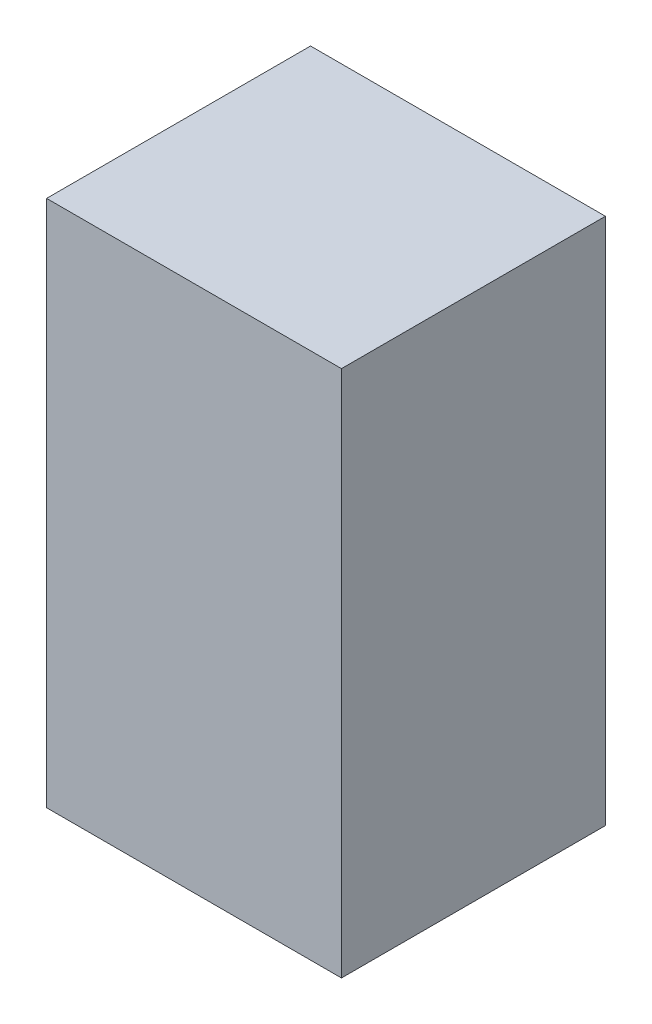
ISO-10303-21;
HEADER;
FILE_DESCRIPTION(('STEP AP214'),'2;1');
FILE_NAME('part.step','',(''),(''),'','','');
FILE_SCHEMA(('AUTOMOTIVE_DESIGN { 1 0 10303 214 1 1 1 1 }'));
ENDSEC;
DATA;
#1=APPLICATION_CONTEXT('core data for automotive mechanical design processes');
#2=APPLICATION_PROTOCOL_DEFINITION('international standard','automotive_design',2000,#1);
#3=PRODUCT_CONTEXT('',#1,'mechanical');
#4=PRODUCT('Part','Part','',(#3));
#5=PRODUCT_RELATED_PRODUCT_CATEGORY('part','',(#4));
#6=PRODUCT_DEFINITION_FORMATION('','',#4);
#7=PRODUCT_DEFINITION_CONTEXT('part definition',#1,'design');
#8=PRODUCT_DEFINITION('design','',#6,#7);
#9=PRODUCT_DEFINITION_SHAPE('','',#8);
#10=(LENGTH_UNIT() NAMED_UNIT(*) SI_UNIT(.MILLI.,.METRE.));
#11=(NAMED_UNIT(*) PLANE_ANGLE_UNIT() SI_UNIT($,.RADIAN.));
#12=(NAMED_UNIT(*) SI_UNIT($,.STERADIAN.) SOLID_ANGLE_UNIT());
#13=UNCERTAINTY_MEASURE_WITH_UNIT(LENGTH_MEASURE(1.E-05),#10,'distance_accuracy_value','');
#14=(GEOMETRIC_REPRESENTATION_CONTEXT(3) GLOBAL_UNCERTAINTY_ASSIGNED_CONTEXT((#13)) GLOBAL_UNIT_ASSIGNED_CONTEXT((#10,
#11,#12)) REPRESENTATION_CONTEXT('',''));
#15=CARTESIAN_POINT('',(0.,0.,0.));
#16=DIRECTION('',(0.,0.,1.));
#17=DIRECTION('',(1.,0.,0.));
#18=AXIS2_PLACEMENT_3D('',#15,#16,#17);
#19=CARTESIAN_POINT('',(10.5586046066208,7.55564646799176,2.));
#20=DIRECTION('',(0.,0.,1.));
#21=DIRECTION('',(1.,0.,0.));
#22=AXIS2_PLACEMENT_3D('',#19,#20,#21);
#23=PLANE('',#22);
#24=DIRECTION('',(-1.,0.,0.));
#25=VECTOR('',#24,1.);
#26=CARTESIAN_POINT('',(11.11720906423,6.55586150390983,2.));
#27=LINE('',#26,#25);
#28=CARTESIAN_POINT('',(11.11720906423,6.55586150390983,2.));
#29=VERTEX_POINT('',#28);
#30=CARTESIAN_POINT('',(10.0000001490116,6.55586150390983,2.));
#31=VERTEX_POINT('',#30);
#32=EDGE_CURVE('E27',#29,#31,#27,.T.);
#33=ORIENTED_EDGE('',*,*,#32,.T.);
#34=DIRECTION('',(0.,1.,0.));
#35=VECTOR('',#34,1.);
#36=CARTESIAN_POINT('',(10.0000001490116,6.55586150390983,2.));
#37=LINE('',#36,#35);
#38=CARTESIAN_POINT('',(10.0000001490116,8.55543143207368,2.));
#39=VERTEX_POINT('',#38);
#40=EDGE_CURVE('E90',#31,#39,#37,.T.);
#41=ORIENTED_EDGE('',*,*,#40,.T.);
#42=DIRECTION('',(1.,0.,0.));
#43=VECTOR('',#42,1.);
#44=CARTESIAN_POINT('',(10.0000001490116,8.55543143207368,2.));
#45=LINE('',#44,#43);
#46=CARTESIAN_POINT('',(11.11720906423,8.55543143207368,2.));
#47=VERTEX_POINT('',#46);
#48=EDGE_CURVE('E83',#39,#47,#45,.T.);
#49=ORIENTED_EDGE('',*,*,#48,.T.);
#50=DIRECTION('',(0.,-1.,0.));
#51=VECTOR('',#50,1.);
#52=CARTESIAN_POINT('',(11.11720906423,8.55543143207368,2.));
#53=LINE('',#52,#51);
#54=EDGE_CURVE('E71',#47,#29,#53,.T.);
#55=ORIENTED_EDGE('',*,*,#54,.T.);
#56=EDGE_LOOP('',(#33,#41,#49,#55));
#57=FACE_BOUND('',#56,.T.);
#58=ADVANCED_FACE('F17',(#57),#23,.F.);
#59=CARTESIAN_POINT('',(10.5586046066208,7.55564646799176,3.));
#60=DIRECTION('',(0.,0.,1.));
#61=DIRECTION('',(1.,0.,0.));
#62=AXIS2_PLACEMENT_3D('',#59,#60,#61);
#63=PLANE('',#62);
#64=DIRECTION('',(1.,0.,0.));
#65=VECTOR('',#64,1.);
#66=CARTESIAN_POINT('',(11.11720906423,6.55586150390983,3.));
#67=LINE('',#66,#65);
#68=CARTESIAN_POINT('',(10.0000001490116,6.55586150390983,3.));
#69=VERTEX_POINT('',#68);
#70=CARTESIAN_POINT('',(11.11720906423,6.55586150390983,3.));
#71=VERTEX_POINT('',#70);
#72=EDGE_CURVE('E11',#69,#71,#67,.T.);
#73=ORIENTED_EDGE('',*,*,#72,.T.);
#74=DIRECTION('',(0.,1.,0.));
#75=VECTOR('',#74,1.);
#76=CARTESIAN_POINT('',(11.11720906423,8.55543143207368,3.));
#77=LINE('',#76,#75);
#78=CARTESIAN_POINT('',(11.11720906423,8.55543143207368,3.));
#79=VERTEX_POINT('',#78);
#80=EDGE_CURVE('E63',#71,#79,#77,.T.);
#81=ORIENTED_EDGE('',*,*,#80,.T.);
#82=DIRECTION('',(-1.,0.,0.));
#83=VECTOR('',#82,1.);
#84=CARTESIAN_POINT('',(10.0000001490116,8.55543143207368,3.));
#85=LINE('',#84,#83);
#86=CARTESIAN_POINT('',(10.0000001490116,8.55543143207368,3.));
#87=VERTEX_POINT('',#86);
#88=EDGE_CURVE('E85',#79,#87,#85,.T.);
#89=ORIENTED_EDGE('',*,*,#88,.T.);
#90=DIRECTION('',(0.,-1.,0.));
#91=VECTOR('',#90,1.);
#92=CARTESIAN_POINT('',(10.0000001490116,6.55586150390983,3.));
#93=LINE('',#92,#91);
#94=EDGE_CURVE('E98',#87,#69,#93,.T.);
#95=ORIENTED_EDGE('',*,*,#94,.T.);
#96=EDGE_LOOP('',(#73,#81,#89,#95));
#97=FACE_BOUND('',#96,.T.);
#98=ADVANCED_FACE('F119',(#97),#63,.T.);
#99=CARTESIAN_POINT('',(10.0000001490116,6.55586150390983,2.));
#100=DIRECTION('',(0.,-1.,0.));
#101=DIRECTION('',(0.,0.,-1.));
#102=AXIS2_PLACEMENT_3D('',#99,#100,#101);
#103=PLANE('',#102);
#104=ORIENTED_EDGE('',*,*,#32,.F.);
#105=DIRECTION('',(0.,0.,1.));
#106=VECTOR('',#105,1.);
#107=CARTESIAN_POINT('',(11.11720906423,6.55586150390983,2.));
#108=LINE('',#107,#106);
#109=EDGE_CURVE('E20',#29,#71,#108,.T.);
#110=ORIENTED_EDGE('',*,*,#109,.T.);
#111=ORIENTED_EDGE('',*,*,#72,.F.);
#112=DIRECTION('',(0.,0.,1.));
#113=VECTOR('',#112,1.);
#114=CARTESIAN_POINT('',(10.0000001490116,6.55586150390983,2.));
#115=LINE('',#114,#113);
#116=EDGE_CURVE('E107',#31,#69,#115,.T.);
#117=ORIENTED_EDGE('',*,*,#116,.F.);
#118=EDGE_LOOP('',(#104,#110,#111,#117));
#119=FACE_BOUND('',#118,.T.);
#120=ADVANCED_FACE('F118',(#119),#103,.T.);
#121=CARTESIAN_POINT('',(11.11720906423,6.55586150390983,2.));
#122=DIRECTION('',(1.,0.,0.));
#123=DIRECTION('',(0.,1.,0.));
#124=AXIS2_PLACEMENT_3D('',#121,#122,#123);
#125=PLANE('',#124);
#126=ORIENTED_EDGE('',*,*,#54,.F.);
#127=DIRECTION('',(0.,0.,1.));
#128=VECTOR('',#127,1.);
#129=CARTESIAN_POINT('',(11.11720906423,8.55543143207368,2.));
#130=LINE('',#129,#128);
#131=EDGE_CURVE('E74',#47,#79,#130,.T.);
#132=ORIENTED_EDGE('',*,*,#131,.T.);
#133=ORIENTED_EDGE('',*,*,#80,.F.);
#134=ORIENTED_EDGE('',*,*,#109,.F.);
#135=EDGE_LOOP('',(#126,#132,#133,#134));
#136=FACE_BOUND('',#135,.T.);
#137=ADVANCED_FACE('F73',(#136),#125,.T.);
#138=CARTESIAN_POINT('',(11.11720906423,8.55543143207368,2.));
#139=DIRECTION('',(0.,1.,0.));
#140=DIRECTION('',(1.,0.,0.));
#141=AXIS2_PLACEMENT_3D('',#138,#139,#140);
#142=PLANE('',#141);
#143=ORIENTED_EDGE('',*,*,#48,.F.);
#144=DIRECTION('',(0.,0.,1.));
#145=VECTOR('',#144,1.);
#146=CARTESIAN_POINT('',(10.0000001490116,8.55543143207368,2.));
#147=LINE('',#146,#145);
#148=EDGE_CURVE('E92',#39,#87,#147,.T.);
#149=ORIENTED_EDGE('',*,*,#148,.T.);
#150=ORIENTED_EDGE('',*,*,#88,.F.);
#151=ORIENTED_EDGE('',*,*,#131,.F.);
#152=EDGE_LOOP('',(#143,#149,#150,#151));
#153=FACE_BOUND('',#152,.T.);
#154=ADVANCED_FACE('F81',(#153),#142,.T.);
#155=CARTESIAN_POINT('',(10.0000001490116,8.55543143207368,2.));
#156=DIRECTION('',(-1.,0.,0.));
#157=DIRECTION('',(0.,0.,1.));
#158=AXIS2_PLACEMENT_3D('',#155,#156,#157);
#159=PLANE('',#158);
#160=ORIENTED_EDGE('',*,*,#40,.F.);
#161=ORIENTED_EDGE('',*,*,#116,.T.);
#162=ORIENTED_EDGE('',*,*,#94,.F.);
#163=ORIENTED_EDGE('',*,*,#148,.F.);
#164=EDGE_LOOP('',(#160,#161,#162,#163));
#165=FACE_BOUND('',#164,.T.);
#166=ADVANCED_FACE('F116',(#165),#159,.T.);
#167=CLOSED_SHELL('',(#58,#98,#120,#137,#154,#166));
#168=MANIFOLD_SOLID_BREP('B1',#167);
#169=ADVANCED_BREP_SHAPE_REPRESENTATION('',(#18,#168),#14);
#170=SHAPE_DEFINITION_REPRESENTATION(#9,#169);
ENDSEC;
END-ISO-10303-21;
